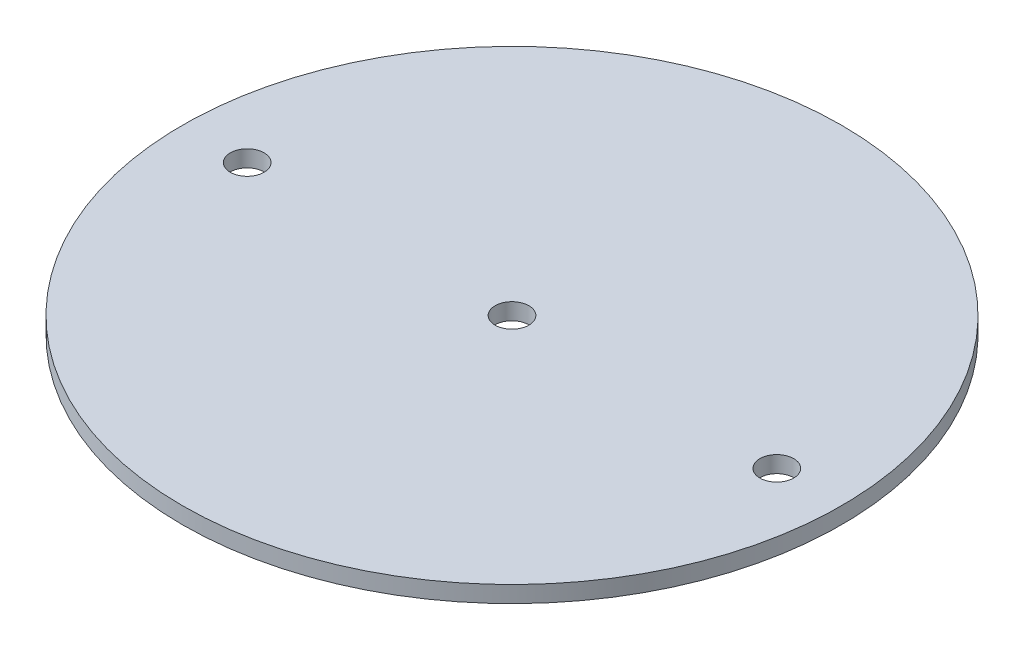
ISO-10303-21;
HEADER;
FILE_DESCRIPTION(('STEP AP214'),'2;1');
FILE_NAME('part.step','',(''),(''),'','','');
FILE_SCHEMA(('AUTOMOTIVE_DESIGN { 1 0 10303 214 1 1 1 1 }'));
ENDSEC;
DATA;
#1=APPLICATION_CONTEXT('core data for automotive mechanical design processes');
#2=APPLICATION_PROTOCOL_DEFINITION('international standard','automotive_design',2000,#1);
#3=PRODUCT_CONTEXT('',#1,'mechanical');
#4=PRODUCT('Part','Part','',(#3));
#5=PRODUCT_RELATED_PRODUCT_CATEGORY('part','',(#4));
#6=PRODUCT_DEFINITION_FORMATION('','',#4);
#7=PRODUCT_DEFINITION_CONTEXT('part definition',#1,'design');
#8=PRODUCT_DEFINITION('design','',#6,#7);
#9=PRODUCT_DEFINITION_SHAPE('','',#8);
#10=(LENGTH_UNIT() NAMED_UNIT(*) SI_UNIT(.MILLI.,.METRE.));
#11=(NAMED_UNIT(*) PLANE_ANGLE_UNIT() SI_UNIT($,.RADIAN.));
#12=(NAMED_UNIT(*) SI_UNIT($,.STERADIAN.) SOLID_ANGLE_UNIT());
#13=UNCERTAINTY_MEASURE_WITH_UNIT(LENGTH_MEASURE(1.E-05),#10,'distance_accuracy_value','');
#14=(GEOMETRIC_REPRESENTATION_CONTEXT(3) GLOBAL_UNCERTAINTY_ASSIGNED_CONTEXT((#13)) GLOBAL_UNIT_ASSIGNED_CONTEXT((#10,
#11,#12)) REPRESENTATION_CONTEXT('',''));
#15=CARTESIAN_POINT('',(0.,0.,0.));
#16=DIRECTION('',(0.,0.,1.));
#17=DIRECTION('',(1.,0.,0.));
#18=AXIS2_PLACEMENT_3D('',#15,#16,#17);
#19=CARTESIAN_POINT('',(0.,3.175,0.));
#20=DIRECTION('',(0.,1.,0.));
#21=DIRECTION('',(0.,0.,1.));
#22=AXIS2_PLACEMENT_3D('',#19,#20,#21);
#23=PLANE('',#22);
#24=CARTESIAN_POINT('',(50.8,3.175,0.));
#25=DIRECTION('',(0.,1.,0.));
#26=DIRECTION('',(0.,0.,1.));
#27=AXIS2_PLACEMENT_3D('',#24,#25,#26);
#28=CIRCLE('',#27,3.2385);
#29=CARTESIAN_POINT('',(50.8,3.175,3.23849999999998));
#30=VERTEX_POINT('',#29);
#31=EDGE_CURVE('E54',#30,#30,#28,.T.);
#32=ORIENTED_EDGE('',*,*,#31,.F.);
#33=EDGE_LOOP('',(#32));
#34=FACE_BOUND('',#33,.T.);
#35=CARTESIAN_POINT('',(0.,3.175,0.));
#36=DIRECTION('',(0.,1.,0.));
#37=DIRECTION('',(0.,0.,1.));
#38=AXIS2_PLACEMENT_3D('',#35,#36,#37);
#39=CIRCLE('',#38,63.2206);
#40=CARTESIAN_POINT('',(0.,3.175,63.2206));
#41=VERTEX_POINT('',#40);
#42=EDGE_CURVE('E10',#41,#41,#39,.T.);
#43=ORIENTED_EDGE('',*,*,#42,.T.);
#44=EDGE_LOOP('',(#43));
#45=FACE_BOUND('',#44,.T.);
#46=CARTESIAN_POINT('',(-50.8,3.175,0.));
#47=DIRECTION('',(0.,1.,0.));
#48=DIRECTION('',(0.,0.,1.));
#49=AXIS2_PLACEMENT_3D('',#46,#47,#48);
#50=CIRCLE('',#49,3.2385);
#51=CARTESIAN_POINT('',(-50.8,3.175,3.2385));
#52=VERTEX_POINT('',#51);
#53=EDGE_CURVE('E49',#52,#52,#50,.T.);
#54=ORIENTED_EDGE('',*,*,#53,.F.);
#55=EDGE_LOOP('',(#54));
#56=FACE_BOUND('',#55,.T.);
#57=CARTESIAN_POINT('',(0.,3.175,0.));
#58=DIRECTION('',(0.,1.,0.));
#59=DIRECTION('',(0.,0.,1.));
#60=AXIS2_PLACEMENT_3D('',#57,#58,#59);
#61=CIRCLE('',#60,3.2385);
#62=CARTESIAN_POINT('',(0.,3.175,3.2385));
#63=VERTEX_POINT('',#62);
#64=EDGE_CURVE('E60',#63,#63,#61,.T.);
#65=ORIENTED_EDGE('',*,*,#64,.F.);
#66=EDGE_LOOP('',(#65));
#67=FACE_BOUND('',#66,.T.);
#68=ADVANCED_FACE('F38',(#34,#45,#56,#67),#23,.T.);
#69=CARTESIAN_POINT('',(0.,0.,0.));
#70=DIRECTION('',(0.,1.,0.));
#71=DIRECTION('',(0.,0.,1.));
#72=AXIS2_PLACEMENT_3D('',#69,#70,#71);
#73=PLANE('',#72);
#74=CARTESIAN_POINT('',(0.,0.,0.));
#75=DIRECTION('',(0.,1.,0.));
#76=DIRECTION('',(0.,0.,1.));
#77=AXIS2_PLACEMENT_3D('',#74,#75,#76);
#78=CIRCLE('',#77,63.2206);
#79=CARTESIAN_POINT('',(0.,0.,63.2206));
#80=VERTEX_POINT('',#79);
#81=EDGE_CURVE('E42',#80,#80,#78,.T.);
#82=ORIENTED_EDGE('',*,*,#81,.F.);
#83=EDGE_LOOP('',(#82));
#84=FACE_BOUND('',#83,.T.);
#85=CARTESIAN_POINT('',(-50.8,0.,0.));
#86=DIRECTION('',(0.,1.,0.));
#87=DIRECTION('',(0.,0.,1.));
#88=AXIS2_PLACEMENT_3D('',#85,#86,#87);
#89=CIRCLE('',#88,3.2385);
#90=CARTESIAN_POINT('',(-50.8,0.,3.2385));
#91=VERTEX_POINT('',#90);
#92=EDGE_CURVE('E51',#91,#91,#89,.T.);
#93=ORIENTED_EDGE('',*,*,#92,.T.);
#94=EDGE_LOOP('',(#93));
#95=FACE_BOUND('',#94,.T.);
#96=CARTESIAN_POINT('',(50.8,0.,0.));
#97=DIRECTION('',(0.,1.,0.));
#98=DIRECTION('',(0.,0.,1.));
#99=AXIS2_PLACEMENT_3D('',#96,#97,#98);
#100=CIRCLE('',#99,3.2385);
#101=CARTESIAN_POINT('',(50.8,0.,3.23849999999998));
#102=VERTEX_POINT('',#101);
#103=EDGE_CURVE('E57',#102,#102,#100,.T.);
#104=ORIENTED_EDGE('',*,*,#103,.T.);
#105=EDGE_LOOP('',(#104));
#106=FACE_BOUND('',#105,.T.);
#107=CARTESIAN_POINT('',(0.,0.,0.));
#108=DIRECTION('',(0.,1.,0.));
#109=DIRECTION('',(0.,0.,1.));
#110=AXIS2_PLACEMENT_3D('',#107,#108,#109);
#111=CIRCLE('',#110,3.2385);
#112=CARTESIAN_POINT('',(0.,0.,3.2385));
#113=VERTEX_POINT('',#112);
#114=EDGE_CURVE('E63',#113,#113,#111,.T.);
#115=ORIENTED_EDGE('',*,*,#114,.T.);
#116=EDGE_LOOP('',(#115));
#117=FACE_BOUND('',#116,.T.);
#118=ADVANCED_FACE('F73',(#84,#95,#106,#117),#73,.F.);
#119=CARTESIAN_POINT('',(0.,3.175,0.));
#120=DIRECTION('',(0.,-1.,0.));
#121=DIRECTION('',(0.,0.,-1.));
#122=AXIS2_PLACEMENT_3D('',#119,#120,#121);
#123=CYLINDRICAL_SURFACE('',#122,63.2206);
#124=ORIENTED_EDGE('',*,*,#42,.F.);
#125=EDGE_LOOP('',(#124));
#126=FACE_BOUND('',#125,.T.);
#127=ORIENTED_EDGE('',*,*,#81,.T.);
#128=EDGE_LOOP('',(#127));
#129=FACE_BOUND('',#128,.T.);
#130=ADVANCED_FACE('F40',(#126,#129),#123,.T.);
#131=CARTESIAN_POINT('',(-50.8,3.175,0.));
#132=DIRECTION('',(0.,-1.,0.));
#133=DIRECTION('',(0.,0.,-1.));
#134=AXIS2_PLACEMENT_3D('',#131,#132,#133);
#135=CYLINDRICAL_SURFACE('',#134,3.2385);
#136=ORIENTED_EDGE('',*,*,#53,.T.);
#137=EDGE_LOOP('',(#136));
#138=FACE_BOUND('',#137,.T.);
#139=ORIENTED_EDGE('',*,*,#92,.F.);
#140=EDGE_LOOP('',(#139));
#141=FACE_BOUND('',#140,.T.);
#142=ADVANCED_FACE('F82',(#138,#141),#135,.F.);
#143=CARTESIAN_POINT('',(50.8,3.175,0.));
#144=DIRECTION('',(0.,-1.,0.));
#145=DIRECTION('',(0.,0.,-1.));
#146=AXIS2_PLACEMENT_3D('',#143,#144,#145);
#147=CYLINDRICAL_SURFACE('',#146,3.2385);
#148=ORIENTED_EDGE('',*,*,#31,.T.);
#149=EDGE_LOOP('',(#148));
#150=FACE_BOUND('',#149,.T.);
#151=ORIENTED_EDGE('',*,*,#103,.F.);
#152=EDGE_LOOP('',(#151));
#153=FACE_BOUND('',#152,.T.);
#154=ADVANCED_FACE('F85',(#150,#153),#147,.F.);
#155=CARTESIAN_POINT('',(0.,3.175,0.));
#156=DIRECTION('',(0.,-1.,0.));
#157=DIRECTION('',(0.,0.,-1.));
#158=AXIS2_PLACEMENT_3D('',#155,#156,#157);
#159=CYLINDRICAL_SURFACE('',#158,3.2385);
#160=ORIENTED_EDGE('',*,*,#64,.T.);
#161=EDGE_LOOP('',(#160));
#162=FACE_BOUND('',#161,.T.);
#163=ORIENTED_EDGE('',*,*,#114,.F.);
#164=EDGE_LOOP('',(#163));
#165=FACE_BOUND('',#164,.T.);
#166=ADVANCED_FACE('F69',(#162,#165),#159,.F.);
#167=CLOSED_SHELL('',(#68,#118,#130,#142,#154,#166));
#168=MANIFOLD_SOLID_BREP('B2',#167);
#169=ADVANCED_BREP_SHAPE_REPRESENTATION('',(#18,#168),#14);
#170=SHAPE_DEFINITION_REPRESENTATION(#9,#169);
ENDSEC;
END-ISO-10303-21;
